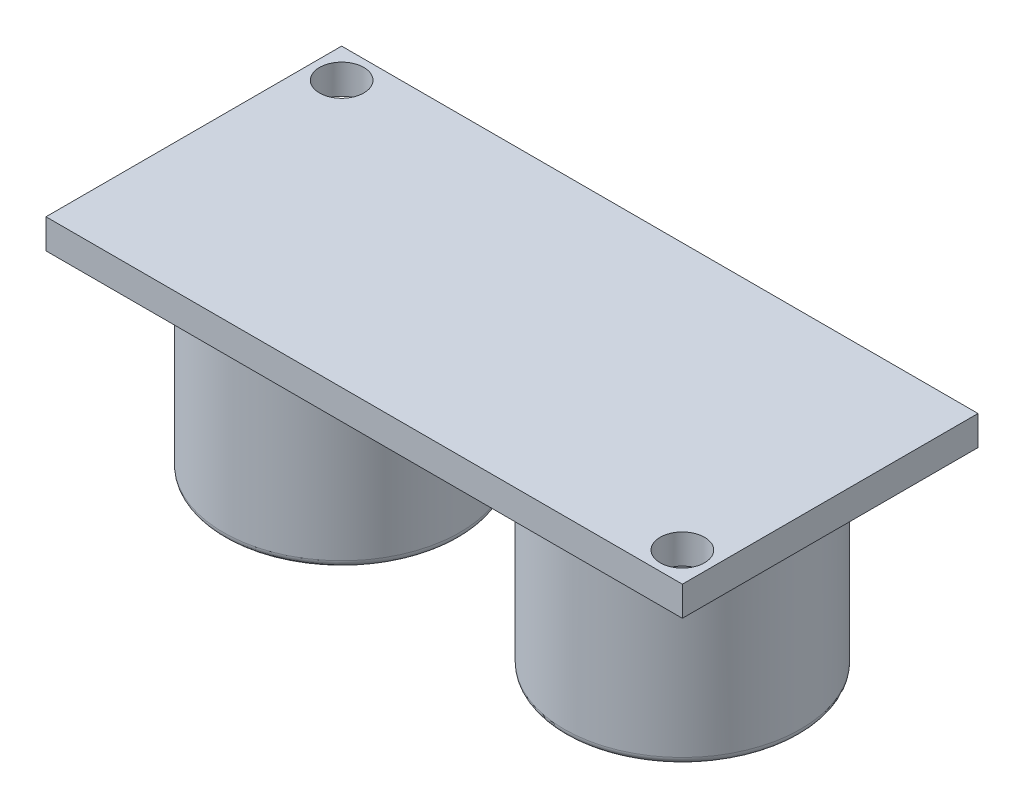
ISO-10303-21;
HEADER;
FILE_DESCRIPTION(('STEP AP214'),'2;1');
FILE_NAME('part.step','',(''),(''),'','','');
FILE_SCHEMA(('AUTOMOTIVE_DESIGN { 1 0 10303 214 1 1 1 1 }'));
ENDSEC;
DATA;
#1=APPLICATION_CONTEXT('core data for automotive mechanical design processes');
#2=APPLICATION_PROTOCOL_DEFINITION('international standard','automotive_design',2000,#1);
#3=PRODUCT_CONTEXT('',#1,'mechanical');
#4=PRODUCT('Part','Part','',(#3));
#5=PRODUCT_RELATED_PRODUCT_CATEGORY('part','',(#4));
#6=PRODUCT_DEFINITION_FORMATION('','',#4);
#7=PRODUCT_DEFINITION_CONTEXT('part definition',#1,'design');
#8=PRODUCT_DEFINITION('design','',#6,#7);
#9=PRODUCT_DEFINITION_SHAPE('','',#8);
#10=(LENGTH_UNIT() NAMED_UNIT(*) SI_UNIT(.MILLI.,.METRE.));
#11=(NAMED_UNIT(*) PLANE_ANGLE_UNIT() SI_UNIT($,.RADIAN.));
#12=(NAMED_UNIT(*) SI_UNIT($,.STERADIAN.) SOLID_ANGLE_UNIT());
#13=UNCERTAINTY_MEASURE_WITH_UNIT(LENGTH_MEASURE(1.E-05),#10,'distance_accuracy_value','');
#14=(GEOMETRIC_REPRESENTATION_CONTEXT(3) GLOBAL_UNCERTAINTY_ASSIGNED_CONTEXT((#13)) GLOBAL_UNIT_ASSIGNED_CONTEXT((#10,
#11,#12)) REPRESENTATION_CONTEXT('',''));
#15=CARTESIAN_POINT('',(0.,0.,0.));
#16=DIRECTION('',(0.,0.,1.));
#17=DIRECTION('',(1.,0.,0.));
#18=AXIS2_PLACEMENT_3D('',#15,#16,#17);
#19=CARTESIAN_POINT('',(0.,-1.,0.));
#20=DIRECTION('',(0.,-1.,0.));
#21=DIRECTION('',(0.,0.,-1.));
#22=AXIS2_PLACEMENT_3D('',#19,#20,#21);
#23=PLANE('',#22);
#24=CARTESIAN_POINT('',(-19.525,-1.,-8.));
#25=DIRECTION('',(0.,-1.,0.));
#26=DIRECTION('',(0.,0.,-1.));
#27=AXIS2_PLACEMENT_3D('',#24,#25,#26);
#28=CIRCLE('',#27,1.49999999999999);
#29=CARTESIAN_POINT('',(-19.525,-1.,-9.49999999999999));
#30=VERTEX_POINT('',#29);
#31=EDGE_CURVE('E242',#30,#30,#28,.T.);
#32=ORIENTED_EDGE('',*,*,#31,.F.);
#33=EDGE_LOOP('',(#32));
#34=FACE_BOUND('',#33,.T.);
#35=CARTESIAN_POINT('',(19.525,-1.,8.));
#36=DIRECTION('',(0.,-1.,0.));
#37=DIRECTION('',(0.,0.,-1.));
#38=AXIS2_PLACEMENT_3D('',#35,#36,#37);
#39=CIRCLE('',#38,1.49999999999999);
#40=CARTESIAN_POINT('',(19.525,-1.,6.50000000000001));
#41=VERTEX_POINT('',#40);
#42=EDGE_CURVE('E171',#41,#41,#39,.T.);
#43=ORIENTED_EDGE('',*,*,#42,.F.);
#44=EDGE_LOOP('',(#43));
#45=FACE_BOUND('',#44,.T.);
#46=CARTESIAN_POINT('',(11.525,-1.,0.));
#47=DIRECTION('',(0.,-1.,0.));
#48=DIRECTION('',(0.,0.,-1.));
#49=AXIS2_PLACEMENT_3D('',#46,#47,#48);
#50=CIRCLE('',#49,8.);
#51=CARTESIAN_POINT('',(11.525,-1.,-8.));
#52=VERTEX_POINT('',#51);
#53=EDGE_CURVE('E167',#52,#52,#50,.T.);
#54=ORIENTED_EDGE('',*,*,#53,.F.);
#55=EDGE_LOOP('',(#54));
#56=FACE_BOUND('',#55,.T.);
#57=CARTESIAN_POINT('',(-11.525,-1.,0.));
#58=DIRECTION('',(0.,-1.,0.));
#59=DIRECTION('',(0.,0.,-1.));
#60=AXIS2_PLACEMENT_3D('',#57,#58,#59);
#61=CIRCLE('',#60,8.);
#62=CARTESIAN_POINT('',(-11.525,-1.,-8.));
#63=VERTEX_POINT('',#62);
#64=EDGE_CURVE('E159',#63,#63,#61,.T.);
#65=ORIENTED_EDGE('',*,*,#64,.F.);
#66=EDGE_LOOP('',(#65));
#67=FACE_BOUND('',#66,.T.);
#68=DIRECTION('',(-1.,0.,0.));
#69=VECTOR('',#68,1.);
#70=CARTESIAN_POINT('',(21.525,-1.,10.));
#71=LINE('',#70,#69);
#72=CARTESIAN_POINT('',(21.525,-1.,10.));
#73=VERTEX_POINT('',#72);
#74=CARTESIAN_POINT('',(-21.525,-1.,10.));
#75=VERTEX_POINT('',#74);
#76=EDGE_CURVE('E133',#73,#75,#71,.T.);
#77=ORIENTED_EDGE('',*,*,#76,.T.);
#78=DIRECTION('',(0.,0.,-1.));
#79=VECTOR('',#78,1.);
#80=CARTESIAN_POINT('',(-21.525,-1.,10.));
#81=LINE('',#80,#79);
#82=CARTESIAN_POINT('',(-21.525,-1.,-10.));
#83=VERTEX_POINT('',#82);
#84=EDGE_CURVE('E136',#75,#83,#81,.T.);
#85=ORIENTED_EDGE('',*,*,#84,.T.);
#86=DIRECTION('',(1.,0.,0.));
#87=VECTOR('',#86,1.);
#88=CARTESIAN_POINT('',(-21.525,-1.,-10.));
#89=LINE('',#88,#87);
#90=CARTESIAN_POINT('',(21.525,-1.,-10.));
#91=VERTEX_POINT('',#90);
#92=EDGE_CURVE('E153',#83,#91,#89,.T.);
#93=ORIENTED_EDGE('',*,*,#92,.T.);
#94=DIRECTION('',(0.,0.,1.));
#95=VECTOR('',#94,1.);
#96=CARTESIAN_POINT('',(21.525,-1.,-10.));
#97=LINE('',#96,#95);
#98=EDGE_CURVE('E144',#91,#73,#97,.T.);
#99=ORIENTED_EDGE('',*,*,#98,.T.);
#100=EDGE_LOOP('',(#77,#85,#93,#99));
#101=FACE_BOUND('',#100,.T.);
#102=DIRECTION('',(0.,0.,1.));
#103=VECTOR('',#102,1.);
#104=CARTESIAN_POINT('',(1.79412522307249,-1.,-5.2589903262948));
#105=LINE('',#104,#103);
#106=CARTESIAN_POINT('',(1.79412522307248,-1.,-8.74100967370521));
#107=VERTEX_POINT('',#106);
#108=CARTESIAN_POINT('',(1.79412522307249,-1.,-5.25899032629479));
#109=VERTEX_POINT('',#108);
#110=EDGE_CURVE('E228',#107,#109,#105,.T.);
#111=ORIENTED_EDGE('',*,*,#110,.F.);
#112=CARTESIAN_POINT('',(0.,-1.,-7.));
#113=DIRECTION('',(0.,-1.,0.));
#114=DIRECTION('',(0.,0.,1.));
#115=AXIS2_PLACEMENT_3D('',#112,#113,#114);
#116=CIRCLE('',#115,2.5);
#117=CARTESIAN_POINT('',(-1.77651089878901,-1.,-8.75897954123517));
#118=VERTEX_POINT('',#117);
#119=EDGE_CURVE('E131',#118,#107,#116,.T.);
#120=ORIENTED_EDGE('',*,*,#119,.F.);
#121=DIRECTION('',(0.,0.,-1.));
#122=VECTOR('',#121,1.);
#123=CARTESIAN_POINT('',(-1.77651089878901,-1.,-8.75897954123517));
#124=LINE('',#123,#122);
#125=CARTESIAN_POINT('',(-1.77651089878901,-1.,-5.24102045876483));
#126=VERTEX_POINT('',#125);
#127=EDGE_CURVE('E127',#126,#118,#124,.T.);
#128=ORIENTED_EDGE('',*,*,#127,.F.);
#129=CARTESIAN_POINT('',(0.,-1.,-7.));
#130=DIRECTION('',(0.,-1.,0.));
#131=DIRECTION('',(0.,0.,1.));
#132=AXIS2_PLACEMENT_3D('',#129,#130,#131);
#133=CIRCLE('',#132,2.5);
#134=EDGE_CURVE('E230',#109,#126,#133,.T.);
#135=ORIENTED_EDGE('',*,*,#134,.F.);
#136=EDGE_LOOP('',(#111,#120,#128,#135));
#137=FACE_BOUND('',#136,.T.);
#138=ADVANCED_FACE('F34',(#34,#45,#56,#67,#101,#137),#23,.T.);
#139=CARTESIAN_POINT('',(21.525,1.,10.));
#140=DIRECTION('',(0.,0.,1.));
#141=DIRECTION('',(1.,0.,0.));
#142=AXIS2_PLACEMENT_3D('',#139,#140,#141);
#143=PLANE('',#142);
#144=ORIENTED_EDGE('',*,*,#76,.F.);
#145=DIRECTION('',(0.,-1.,0.));
#146=VECTOR('',#145,1.);
#147=CARTESIAN_POINT('',(21.525,1.,10.));
#148=LINE('',#147,#146);
#149=CARTESIAN_POINT('',(21.525,1.,10.));
#150=VERTEX_POINT('',#149);
#151=EDGE_CURVE('E58',#150,#73,#148,.T.);
#152=ORIENTED_EDGE('',*,*,#151,.F.);
#153=DIRECTION('',(-1.,0.,0.));
#154=VECTOR('',#153,1.);
#155=CARTESIAN_POINT('',(21.525,1.,10.));
#156=LINE('',#155,#154);
#157=CARTESIAN_POINT('',(-21.525,1.,10.));
#158=VERTEX_POINT('',#157);
#159=EDGE_CURVE('E141',#150,#158,#156,.T.);
#160=ORIENTED_EDGE('',*,*,#159,.T.);
#161=DIRECTION('',(0.,-1.,0.));
#162=VECTOR('',#161,1.);
#163=CARTESIAN_POINT('',(-21.525,1.,10.));
#164=LINE('',#163,#162);
#165=EDGE_CURVE('E84',#158,#75,#164,.T.);
#166=ORIENTED_EDGE('',*,*,#165,.T.);
#167=EDGE_LOOP('',(#144,#152,#160,#166));
#168=FACE_BOUND('',#167,.T.);
#169=ADVANCED_FACE('F195',(#168),#143,.T.);
#170=CARTESIAN_POINT('',(21.525,1.,-10.));
#171=DIRECTION('',(1.,0.,0.));
#172=DIRECTION('',(0.,0.,-1.));
#173=AXIS2_PLACEMENT_3D('',#170,#171,#172);
#174=PLANE('',#173);
#175=ORIENTED_EDGE('',*,*,#98,.F.);
#176=DIRECTION('',(0.,-1.,0.));
#177=VECTOR('',#176,1.);
#178=CARTESIAN_POINT('',(21.525,1.,-10.));
#179=LINE('',#178,#177);
#180=CARTESIAN_POINT('',(21.525,1.,-10.));
#181=VERTEX_POINT('',#180);
#182=EDGE_CURVE('E160',#181,#91,#179,.T.);
#183=ORIENTED_EDGE('',*,*,#182,.F.);
#184=DIRECTION('',(0.,0.,1.));
#185=VECTOR('',#184,1.);
#186=CARTESIAN_POINT('',(21.525,1.,-10.));
#187=LINE('',#186,#185);
#188=EDGE_CURVE('E149',#181,#150,#187,.T.);
#189=ORIENTED_EDGE('',*,*,#188,.T.);
#190=ORIENTED_EDGE('',*,*,#151,.T.);
#191=EDGE_LOOP('',(#175,#183,#189,#190));
#192=FACE_BOUND('',#191,.T.);
#193=ADVANCED_FACE('F201',(#192),#174,.T.);
#194=CARTESIAN_POINT('',(-21.525,1.,-10.));
#195=DIRECTION('',(0.,0.,-1.));
#196=DIRECTION('',(-1.,0.,0.));
#197=AXIS2_PLACEMENT_3D('',#194,#195,#196);
#198=PLANE('',#197);
#199=ORIENTED_EDGE('',*,*,#92,.F.);
#200=DIRECTION('',(0.,-1.,0.));
#201=VECTOR('',#200,1.);
#202=CARTESIAN_POINT('',(-21.525,1.,-10.));
#203=LINE('',#202,#201);
#204=CARTESIAN_POINT('',(-21.525,1.,-10.));
#205=VERTEX_POINT('',#204);
#206=EDGE_CURVE('E162',#205,#83,#203,.T.);
#207=ORIENTED_EDGE('',*,*,#206,.F.);
#208=DIRECTION('',(1.,0.,0.));
#209=VECTOR('',#208,1.);
#210=CARTESIAN_POINT('',(-21.525,1.,-10.));
#211=LINE('',#210,#209);
#212=EDGE_CURVE('E146',#205,#181,#211,.T.);
#213=ORIENTED_EDGE('',*,*,#212,.T.);
#214=ORIENTED_EDGE('',*,*,#182,.T.);
#215=EDGE_LOOP('',(#199,#207,#213,#214));
#216=FACE_BOUND('',#215,.T.);
#217=ADVANCED_FACE('F211',(#216),#198,.T.);
#218=CARTESIAN_POINT('',(-21.525,1.,10.));
#219=DIRECTION('',(-1.,0.,0.));
#220=DIRECTION('',(0.,0.,1.));
#221=AXIS2_PLACEMENT_3D('',#218,#219,#220);
#222=PLANE('',#221);
#223=ORIENTED_EDGE('',*,*,#84,.F.);
#224=ORIENTED_EDGE('',*,*,#165,.F.);
#225=DIRECTION('',(0.,0.,-1.));
#226=VECTOR('',#225,1.);
#227=CARTESIAN_POINT('',(-21.525,1.,10.));
#228=LINE('',#227,#226);
#229=EDGE_CURVE('E143',#158,#205,#228,.T.);
#230=ORIENTED_EDGE('',*,*,#229,.T.);
#231=ORIENTED_EDGE('',*,*,#206,.T.);
#232=EDGE_LOOP('',(#223,#224,#230,#231));
#233=FACE_BOUND('',#232,.T.);
#234=ADVANCED_FACE('F214',(#233),#222,.T.);
#235=CARTESIAN_POINT('',(0.,1.,0.));
#236=DIRECTION('',(0.,-1.,0.));
#237=DIRECTION('',(0.,0.,-1.));
#238=AXIS2_PLACEMENT_3D('',#235,#236,#237);
#239=PLANE('',#238);
#240=CARTESIAN_POINT('',(-19.525,1.,-8.));
#241=DIRECTION('',(0.,1.,0.));
#242=DIRECTION('',(0.,0.,1.));
#243=AXIS2_PLACEMENT_3D('',#240,#241,#242);
#244=CIRCLE('',#243,1.49999999999999);
#245=CARTESIAN_POINT('',(-19.525,1.,-6.50000000000001));
#246=VERTEX_POINT('',#245);
#247=EDGE_CURVE('E245',#246,#246,#244,.T.);
#248=ORIENTED_EDGE('',*,*,#247,.F.);
#249=EDGE_LOOP('',(#248));
#250=FACE_BOUND('',#249,.T.);
#251=CARTESIAN_POINT('',(19.525,1.,8.));
#252=DIRECTION('',(0.,1.,0.));
#253=DIRECTION('',(0.,0.,1.));
#254=AXIS2_PLACEMENT_3D('',#251,#252,#253);
#255=CIRCLE('',#254,1.49999999999999);
#256=CARTESIAN_POINT('',(19.525,1.,9.49999999999999));
#257=VERTEX_POINT('',#256);
#258=EDGE_CURVE('E174',#257,#257,#255,.T.);
#259=ORIENTED_EDGE('',*,*,#258,.F.);
#260=EDGE_LOOP('',(#259));
#261=FACE_BOUND('',#260,.T.);
#262=ORIENTED_EDGE('',*,*,#159,.F.);
#263=ORIENTED_EDGE('',*,*,#188,.F.);
#264=ORIENTED_EDGE('',*,*,#212,.F.);
#265=ORIENTED_EDGE('',*,*,#229,.F.);
#266=EDGE_LOOP('',(#262,#263,#264,#265));
#267=FACE_BOUND('',#266,.T.);
#268=ADVANCED_FACE('F207',(#250,#261,#267),#239,.F.);
#269=CARTESIAN_POINT('',(0.,-3.5,-7.));
#270=DIRECTION('',(0.,1.,0.));
#271=DIRECTION('',(0.,0.,1.));
#272=AXIS2_PLACEMENT_3D('',#269,#270,#271);
#273=CYLINDRICAL_SURFACE('',#272,2.5);
#274=ORIENTED_EDGE('',*,*,#119,.T.);
#275=DIRECTION('',(0.,1.,0.));
#276=VECTOR('',#275,1.);
#277=CARTESIAN_POINT('',(1.79412522307248,-3.5,-8.74100967370521));
#278=LINE('',#277,#276);
#279=CARTESIAN_POINT('',(1.79412522307248,-3.5,-8.74100967370521));
#280=VERTEX_POINT('',#279);
#281=EDGE_CURVE('E112',#280,#107,#278,.T.);
#282=ORIENTED_EDGE('',*,*,#281,.F.);
#283=CARTESIAN_POINT('',(0.,-3.5,-7.));
#284=DIRECTION('',(0.,-1.,0.));
#285=DIRECTION('',(0.,0.,1.));
#286=AXIS2_PLACEMENT_3D('',#283,#284,#285);
#287=CIRCLE('',#286,2.5);
#288=CARTESIAN_POINT('',(-1.77651089878901,-3.5,-8.75897954123517));
#289=VERTEX_POINT('',#288);
#290=EDGE_CURVE('E119',#289,#280,#287,.T.);
#291=ORIENTED_EDGE('',*,*,#290,.F.);
#292=DIRECTION('',(0.,1.,0.));
#293=VECTOR('',#292,1.);
#294=CARTESIAN_POINT('',(-1.77651089878901,-3.5,-8.75897954123517));
#295=LINE('',#294,#293);
#296=EDGE_CURVE('E237',#289,#118,#295,.T.);
#297=ORIENTED_EDGE('',*,*,#296,.T.);
#298=EDGE_LOOP('',(#274,#282,#291,#297));
#299=FACE_BOUND('',#298,.T.);
#300=ADVANCED_FACE('F129',(#299),#273,.T.);
#301=CARTESIAN_POINT('',(1.79412522307249,-3.5,-5.2589903262948));
#302=DIRECTION('',(-1.,0.,0.));
#303=DIRECTION('',(0.,0.,1.));
#304=AXIS2_PLACEMENT_3D('',#301,#302,#303);
#305=PLANE('',#304);
#306=ORIENTED_EDGE('',*,*,#110,.T.);
#307=DIRECTION('',(0.,1.,0.));
#308=VECTOR('',#307,1.);
#309=CARTESIAN_POINT('',(1.79412522307249,-3.5,-5.25899032629479));
#310=LINE('',#309,#308);
#311=CARTESIAN_POINT('',(1.79412522307249,-3.5,-5.25899032629479));
#312=VERTEX_POINT('',#311);
#313=EDGE_CURVE('E115',#312,#109,#310,.T.);
#314=ORIENTED_EDGE('',*,*,#313,.F.);
#315=DIRECTION('',(0.,0.,1.));
#316=VECTOR('',#315,1.);
#317=CARTESIAN_POINT('',(1.79412522307249,-3.5,-5.2589903262948));
#318=LINE('',#317,#316);
#319=EDGE_CURVE('E108',#280,#312,#318,.T.);
#320=ORIENTED_EDGE('',*,*,#319,.F.);
#321=ORIENTED_EDGE('',*,*,#281,.T.);
#322=EDGE_LOOP('',(#306,#314,#320,#321));
#323=FACE_BOUND('',#322,.T.);
#324=ADVANCED_FACE('F110',(#323),#305,.F.);
#325=CARTESIAN_POINT('',(0.,-3.5,-7.));
#326=DIRECTION('',(0.,1.,0.));
#327=DIRECTION('',(0.,0.,1.));
#328=AXIS2_PLACEMENT_3D('',#325,#326,#327);
#329=CYLINDRICAL_SURFACE('',#328,2.5);
#330=ORIENTED_EDGE('',*,*,#134,.T.);
#331=DIRECTION('',(0.,1.,0.));
#332=VECTOR('',#331,1.);
#333=CARTESIAN_POINT('',(-1.77651089878901,-3.5,-5.24102045876483));
#334=LINE('',#333,#332);
#335=CARTESIAN_POINT('',(-1.77651089878901,-3.5,-5.24102045876483));
#336=VERTEX_POINT('',#335);
#337=EDGE_CURVE('E49',#336,#126,#334,.T.);
#338=ORIENTED_EDGE('',*,*,#337,.F.);
#339=CARTESIAN_POINT('',(0.,-3.5,-7.));
#340=DIRECTION('',(0.,-1.,0.));
#341=DIRECTION('',(0.,0.,1.));
#342=AXIS2_PLACEMENT_3D('',#339,#340,#341);
#343=CIRCLE('',#342,2.5);
#344=EDGE_CURVE('E118',#312,#336,#343,.T.);
#345=ORIENTED_EDGE('',*,*,#344,.F.);
#346=ORIENTED_EDGE('',*,*,#313,.T.);
#347=EDGE_LOOP('',(#330,#338,#345,#346));
#348=FACE_BOUND('',#347,.T.);
#349=ADVANCED_FACE('F281',(#348),#329,.T.);
#350=CARTESIAN_POINT('',(-1.77651089878901,-3.5,-8.75897954123517));
#351=DIRECTION('',(1.,0.,0.));
#352=DIRECTION('',(0.,0.,-1.));
#353=AXIS2_PLACEMENT_3D('',#350,#351,#352);
#354=PLANE('',#353);
#355=ORIENTED_EDGE('',*,*,#127,.T.);
#356=ORIENTED_EDGE('',*,*,#296,.F.);
#357=DIRECTION('',(0.,0.,-1.));
#358=VECTOR('',#357,1.);
#359=CARTESIAN_POINT('',(-1.77651089878901,-3.5,-8.75897954123517));
#360=LINE('',#359,#358);
#361=EDGE_CURVE('E123',#336,#289,#360,.T.);
#362=ORIENTED_EDGE('',*,*,#361,.F.);
#363=ORIENTED_EDGE('',*,*,#337,.T.);
#364=EDGE_LOOP('',(#355,#356,#362,#363));
#365=FACE_BOUND('',#364,.T.);
#366=ADVANCED_FACE('F278',(#365),#354,.F.);
#367=CARTESIAN_POINT('',(0.,-3.5,-7.));
#368=DIRECTION('',(0.,1.,0.));
#369=DIRECTION('',(0.,0.,1.));
#370=AXIS2_PLACEMENT_3D('',#367,#368,#369);
#371=PLANE('',#370);
#372=ORIENTED_EDGE('',*,*,#290,.T.);
#373=ORIENTED_EDGE('',*,*,#319,.T.);
#374=ORIENTED_EDGE('',*,*,#344,.T.);
#375=ORIENTED_EDGE('',*,*,#361,.T.);
#376=EDGE_LOOP('',(#372,#373,#374,#375));
#377=FACE_BOUND('',#376,.T.);
#378=ADVANCED_FACE('F122',(#377),#371,.F.);
#379=CARTESIAN_POINT('',(-11.525,-14.,0.));
#380=DIRECTION('',(0.,1.,0.));
#381=DIRECTION('',(0.,0.,1.));
#382=AXIS2_PLACEMENT_3D('',#379,#380,#381);
#383=CYLINDRICAL_SURFACE('',#382,8.);
#384=CARTESIAN_POINT('',(-11.525,-13.5,0.));
#385=DIRECTION('',(0.,-1.,0.));
#386=DIRECTION('',(0.,0.,-1.));
#387=AXIS2_PLACEMENT_3D('',#384,#385,#386);
#388=CIRCLE('',#387,8.);
#389=CARTESIAN_POINT('',(-11.525,-13.5,-8.));
#390=VERTEX_POINT('',#389);
#391=EDGE_CURVE('E42',#390,#390,#388,.F.);
#392=ORIENTED_EDGE('',*,*,#391,.T.);
#393=EDGE_LOOP('',(#392));
#394=FACE_BOUND('',#393,.T.);
#395=ORIENTED_EDGE('',*,*,#64,.T.);
#396=EDGE_LOOP('',(#395));
#397=FACE_BOUND('',#396,.T.);
#398=ADVANCED_FACE('F182',(#394,#397),#383,.T.);
#399=CARTESIAN_POINT('',(-3.525,-14.,0.));
#400=DIRECTION('',(0.,-1.,0.));
#401=DIRECTION('',(0.,0.,-1.));
#402=AXIS2_PLACEMENT_3D('',#399,#400,#401);
#403=PLANE('',#402);
#404=CARTESIAN_POINT('',(-11.525,-14.,0.));
#405=DIRECTION('',(0.,-1.,0.));
#406=DIRECTION('',(0.,0.,-1.));
#407=AXIS2_PLACEMENT_3D('',#404,#405,#406);
#408=CIRCLE('',#407,7.5);
#409=CARTESIAN_POINT('',(-11.525,-14.,-7.5));
#410=VERTEX_POINT('',#409);
#411=EDGE_CURVE('E11',#410,#410,#408,.T.);
#412=ORIENTED_EDGE('',*,*,#411,.T.);
#413=EDGE_LOOP('',(#412));
#414=FACE_BOUND('',#413,.T.);
#415=ADVANCED_FACE('F269',(#414),#403,.T.);
#416=CARTESIAN_POINT('',(11.525,-14.,0.));
#417=DIRECTION('',(0.,1.,0.));
#418=DIRECTION('',(-1.,0.,0.));
#419=AXIS2_PLACEMENT_3D('',#416,#417,#418);
#420=CYLINDRICAL_SURFACE('',#419,8.);
#421=CARTESIAN_POINT('',(11.525,-13.5,0.));
#422=DIRECTION('',(0.,-1.,0.));
#423=DIRECTION('',(1.,0.,0.));
#424=AXIS2_PLACEMENT_3D('',#421,#422,#423);
#425=CIRCLE('',#424,8.);
#426=CARTESIAN_POINT('',(19.525,-13.5,0.));
#427=VERTEX_POINT('',#426);
#428=EDGE_CURVE('E170',#427,#427,#425,.F.);
#429=ORIENTED_EDGE('',*,*,#428,.T.);
#430=EDGE_LOOP('',(#429));
#431=FACE_BOUND('',#430,.T.);
#432=ORIENTED_EDGE('',*,*,#53,.T.);
#433=EDGE_LOOP('',(#432));
#434=FACE_BOUND('',#433,.T.);
#435=ADVANCED_FACE('F263',(#431,#434),#420,.T.);
#436=CARTESIAN_POINT('',(19.525,-14.,0.));
#437=DIRECTION('',(0.,-1.,0.));
#438=DIRECTION('',(1.,0.,0.));
#439=AXIS2_PLACEMENT_3D('',#436,#437,#438);
#440=PLANE('',#439);
#441=CARTESIAN_POINT('',(11.525,-14.,0.));
#442=DIRECTION('',(0.,-1.,0.));
#443=DIRECTION('',(1.,0.,0.));
#444=AXIS2_PLACEMENT_3D('',#441,#442,#443);
#445=CIRCLE('',#444,7.5);
#446=CARTESIAN_POINT('',(19.025,-14.,0.));
#447=VERTEX_POINT('',#446);
#448=EDGE_CURVE('E177',#447,#447,#445,.T.);
#449=ORIENTED_EDGE('',*,*,#448,.T.);
#450=EDGE_LOOP('',(#449));
#451=FACE_BOUND('',#450,.T.);
#452=ADVANCED_FACE('F254',(#451),#440,.T.);
#453=CARTESIAN_POINT('',(19.525,1.,8.));
#454=DIRECTION('',(0.,1.,0.));
#455=DIRECTION('',(0.,0.,1.));
#456=AXIS2_PLACEMENT_3D('',#453,#454,#455);
#457=CYLINDRICAL_SURFACE('',#456,1.49999999999999);
#458=ORIENTED_EDGE('',*,*,#42,.T.);
#459=EDGE_LOOP('',(#458));
#460=FACE_BOUND('',#459,.T.);
#461=ORIENTED_EDGE('',*,*,#258,.T.);
#462=EDGE_LOOP('',(#461));
#463=FACE_BOUND('',#462,.T.);
#464=ADVANCED_FACE('F252',(#460,#463),#457,.F.);
#465=CARTESIAN_POINT('',(-19.525,1.,-8.));
#466=DIRECTION('',(0.,1.,0.));
#467=DIRECTION('',(0.,0.,1.));
#468=AXIS2_PLACEMENT_3D('',#465,#466,#467);
#469=CYLINDRICAL_SURFACE('',#468,1.49999999999999);
#470=ORIENTED_EDGE('',*,*,#31,.T.);
#471=EDGE_LOOP('',(#470));
#472=FACE_BOUND('',#471,.T.);
#473=ORIENTED_EDGE('',*,*,#247,.T.);
#474=EDGE_LOOP('',(#473));
#475=FACE_BOUND('',#474,.T.);
#476=ADVANCED_FACE('F191',(#472,#475),#469,.F.);
#477=CARTESIAN_POINT('',(11.525,-13.5,0.));
#478=DIRECTION('',(0.,-1.,0.));
#479=DIRECTION('',(1.,0.,0.));
#480=AXIS2_PLACEMENT_3D('',#477,#478,#479);
#481=TOROIDAL_SURFACE('',#480,7.5,0.5);
#482=ORIENTED_EDGE('',*,*,#448,.F.);
#483=EDGE_LOOP('',(#482));
#484=FACE_BOUND('',#483,.T.);
#485=ORIENTED_EDGE('',*,*,#428,.F.);
#486=EDGE_LOOP('',(#485));
#487=FACE_BOUND('',#486,.T.);
#488=ADVANCED_FACE('F186',(#484,#487),#481,.T.);
#489=CARTESIAN_POINT('',(-11.525,-13.5,0.));
#490=DIRECTION('',(0.,-1.,0.));
#491=DIRECTION('',(0.,0.,-1.));
#492=AXIS2_PLACEMENT_3D('',#489,#490,#491);
#493=TOROIDAL_SURFACE('',#492,7.5,0.5);
#494=ORIENTED_EDGE('',*,*,#411,.F.);
#495=EDGE_LOOP('',(#494));
#496=FACE_BOUND('',#495,.T.);
#497=ORIENTED_EDGE('',*,*,#391,.F.);
#498=EDGE_LOOP('',(#497));
#499=FACE_BOUND('',#498,.T.);
#500=ADVANCED_FACE('F36',(#496,#499),#493,.T.);
#501=CLOSED_SHELL('',(#138,#169,#193,#217,#234,#268,#300,#324,#349,#366,#378,#398,#415,#435,
#452,#464,#476,#488,#500));
#502=MANIFOLD_SOLID_BREP('B2',#501);
#503=ADVANCED_BREP_SHAPE_REPRESENTATION('',(#18,#502),#14);
#504=SHAPE_DEFINITION_REPRESENTATION(#9,#503);
ENDSEC;
END-ISO-10303-21;
